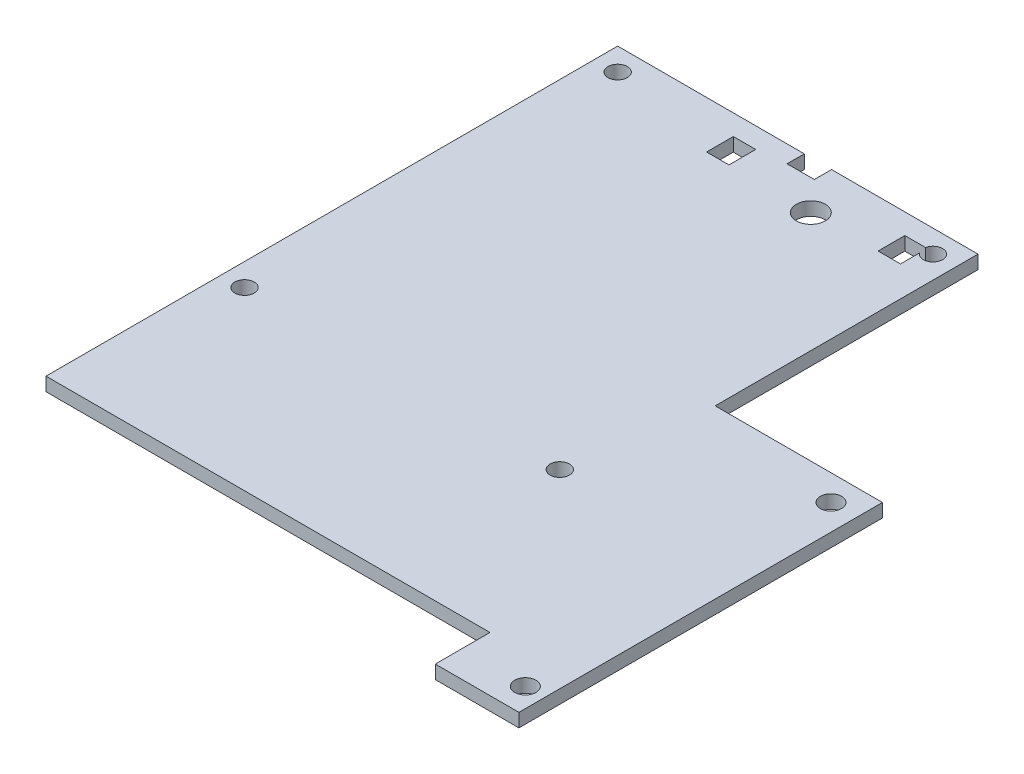
ISO-10303-21;
HEADER;
FILE_DESCRIPTION(('STEP AP214'),'2;1');
FILE_NAME('part.step','',(''),(''),'','','');
FILE_SCHEMA(('AUTOMOTIVE_DESIGN { 1 0 10303 214 1 1 1 1 }'));
ENDSEC;
DATA;
#1=APPLICATION_CONTEXT('core data for automotive mechanical design processes');
#2=APPLICATION_PROTOCOL_DEFINITION('international standard','automotive_design',2000,#1);
#3=PRODUCT_CONTEXT('',#1,'mechanical');
#4=PRODUCT('Part','Part','',(#3));
#5=PRODUCT_RELATED_PRODUCT_CATEGORY('part','',(#4));
#6=PRODUCT_DEFINITION_FORMATION('','',#4);
#7=PRODUCT_DEFINITION_CONTEXT('part definition',#1,'design');
#8=PRODUCT_DEFINITION('design','',#6,#7);
#9=PRODUCT_DEFINITION_SHAPE('','',#8);
#10=(LENGTH_UNIT() NAMED_UNIT(*) SI_UNIT(.MILLI.,.METRE.));
#11=(NAMED_UNIT(*) PLANE_ANGLE_UNIT() SI_UNIT($,.RADIAN.));
#12=(NAMED_UNIT(*) SI_UNIT($,.STERADIAN.) SOLID_ANGLE_UNIT());
#13=UNCERTAINTY_MEASURE_WITH_UNIT(LENGTH_MEASURE(1.E-05),#10,'distance_accuracy_value','');
#14=(GEOMETRIC_REPRESENTATION_CONTEXT(3) GLOBAL_UNCERTAINTY_ASSIGNED_CONTEXT((#13)) GLOBAL_UNIT_ASSIGNED_CONTEXT((#10,
#11,#12)) REPRESENTATION_CONTEXT('',''));
#15=CARTESIAN_POINT('',(0.,0.,0.));
#16=DIRECTION('',(0.,0.,1.));
#17=DIRECTION('',(1.,0.,0.));
#18=AXIS2_PLACEMENT_3D('',#15,#16,#17);
#19=CARTESIAN_POINT('',(0.,-2.1,-88.85));
#20=DIRECTION('',(0.,0.,1.));
#21=DIRECTION('',(1.,0.,0.));
#22=AXIS2_PLACEMENT_3D('',#19,#20,#21);
#23=PLANE('',#22);
#24=DIRECTION('',(1.,0.,0.));
#25=VECTOR('',#24,1.);
#26=CARTESIAN_POINT('',(0.,0.,-88.85));
#27=LINE('',#26,#25);
#28=CARTESIAN_POINT('',(33.24,0.,-88.85));
#29=VERTEX_POINT('',#28);
#30=CARTESIAN_POINT('',(56.,0.,-88.85));
#31=VERTEX_POINT('',#30);
#32=EDGE_CURVE('E255',#29,#31,#27,.T.);
#33=ORIENTED_EDGE('',*,*,#32,.T.);
#34=DIRECTION('',(0.,1.,0.));
#35=VECTOR('',#34,1.);
#36=CARTESIAN_POINT('',(56.,-2.1,-88.85));
#37=LINE('',#36,#35);
#38=CARTESIAN_POINT('',(56.,-2.1,-88.85));
#39=VERTEX_POINT('',#38);
#40=EDGE_CURVE('E11',#39,#31,#37,.T.);
#41=ORIENTED_EDGE('',*,*,#40,.F.);
#42=DIRECTION('',(1.,0.,0.));
#43=VECTOR('',#42,1.);
#44=CARTESIAN_POINT('',(0.,-2.1,-88.85));
#45=LINE('',#44,#43);
#46=CARTESIAN_POINT('',(33.24,-2.1,-88.85));
#47=VERTEX_POINT('',#46);
#48=EDGE_CURVE('E369',#47,#39,#45,.T.);
#49=ORIENTED_EDGE('',*,*,#48,.F.);
#50=DIRECTION('',(0.,1.,0.));
#51=VECTOR('',#50,1.);
#52=CARTESIAN_POINT('',(33.24,-2.1,-88.85));
#53=LINE('',#52,#51);
#54=EDGE_CURVE('E302',#47,#29,#53,.T.);
#55=ORIENTED_EDGE('',*,*,#54,.T.);
#56=EDGE_LOOP('',(#33,#41,#49,#55));
#57=FACE_BOUND('',#56,.T.);
#58=ADVANCED_FACE('F34',(#57),#23,.F.);
#59=CARTESIAN_POINT('',(56.,-2.1,0.));
#60=DIRECTION('',(-1.,0.,0.));
#61=DIRECTION('',(0.,0.,1.));
#62=AXIS2_PLACEMENT_3D('',#59,#60,#61);
#63=PLANE('',#62);
#64=DIRECTION('',(0.,0.,1.));
#65=VECTOR('',#64,1.);
#66=CARTESIAN_POINT('',(56.,0.,0.));
#67=LINE('',#66,#65);
#68=CARTESIAN_POINT('',(56.,0.,-48.));
#69=VERTEX_POINT('',#68);
#70=EDGE_CURVE('E117',#31,#69,#67,.T.);
#71=ORIENTED_EDGE('',*,*,#70,.T.);
#72=DIRECTION('',(0.,1.,0.));
#73=VECTOR('',#72,1.);
#74=CARTESIAN_POINT('',(56.,-2.1,-48.));
#75=LINE('',#74,#73);
#76=CARTESIAN_POINT('',(56.,-2.1,-48.));
#77=VERTEX_POINT('',#76);
#78=EDGE_CURVE('E44',#77,#69,#75,.T.);
#79=ORIENTED_EDGE('',*,*,#78,.F.);
#80=DIRECTION('',(0.,0.,1.));
#81=VECTOR('',#80,1.);
#82=CARTESIAN_POINT('',(56.,-2.1,0.));
#83=LINE('',#82,#81);
#84=EDGE_CURVE('E52',#39,#77,#83,.T.);
#85=ORIENTED_EDGE('',*,*,#84,.F.);
#86=ORIENTED_EDGE('',*,*,#40,.T.);
#87=EDGE_LOOP('',(#71,#79,#85,#86));
#88=FACE_BOUND('',#87,.T.);
#89=ADVANCED_FACE('F420',(#88),#63,.F.);
#90=CARTESIAN_POINT('',(0.,-2.1,-48.));
#91=DIRECTION('',(0.,0.,1.));
#92=DIRECTION('',(1.,0.,0.));
#93=AXIS2_PLACEMENT_3D('',#90,#91,#92);
#94=PLANE('',#93);
#95=DIRECTION('',(1.,0.,0.));
#96=VECTOR('',#95,1.);
#97=CARTESIAN_POINT('',(0.,0.,-48.));
#98=LINE('',#97,#96);
#99=CARTESIAN_POINT('',(82.,0.,-48.));
#100=VERTEX_POINT('',#99);
#101=EDGE_CURVE('E196',#69,#100,#98,.T.);
#102=ORIENTED_EDGE('',*,*,#101,.T.);
#103=DIRECTION('',(0.,1.,0.));
#104=VECTOR('',#103,1.);
#105=CARTESIAN_POINT('',(82.,-2.1,-48.));
#106=LINE('',#105,#104);
#107=CARTESIAN_POINT('',(82.,-2.1,-48.));
#108=VERTEX_POINT('',#107);
#109=EDGE_CURVE('E194',#108,#100,#106,.T.);
#110=ORIENTED_EDGE('',*,*,#109,.F.);
#111=DIRECTION('',(1.,0.,0.));
#112=VECTOR('',#111,1.);
#113=CARTESIAN_POINT('',(0.,-2.1,-48.));
#114=LINE('',#113,#112);
#115=EDGE_CURVE('E185',#77,#108,#114,.T.);
#116=ORIENTED_EDGE('',*,*,#115,.F.);
#117=ORIENTED_EDGE('',*,*,#78,.T.);
#118=EDGE_LOOP('',(#102,#110,#116,#117));
#119=FACE_BOUND('',#118,.T.);
#120=ADVANCED_FACE('F195',(#119),#94,.F.);
#121=CARTESIAN_POINT('',(82.,-2.1,0.));
#122=DIRECTION('',(-1.,0.,0.));
#123=DIRECTION('',(0.,0.,1.));
#124=AXIS2_PLACEMENT_3D('',#121,#122,#123);
#125=PLANE('',#124);
#126=DIRECTION('',(0.,0.,1.));
#127=VECTOR('',#126,1.);
#128=CARTESIAN_POINT('',(82.,0.,0.));
#129=LINE('',#128,#127);
#130=CARTESIAN_POINT('',(82.,0.,8.5));
#131=VERTEX_POINT('',#130);
#132=EDGE_CURVE('E275',#100,#131,#129,.T.);
#133=ORIENTED_EDGE('',*,*,#132,.T.);
#134=DIRECTION('',(0.,1.,0.));
#135=VECTOR('',#134,1.);
#136=CARTESIAN_POINT('',(82.,-2.1,8.5));
#137=LINE('',#136,#135);
#138=CARTESIAN_POINT('',(82.,-2.1,8.5));
#139=VERTEX_POINT('',#138);
#140=EDGE_CURVE('E199',#139,#131,#137,.T.);
#141=ORIENTED_EDGE('',*,*,#140,.F.);
#142=DIRECTION('',(0.,0.,1.));
#143=VECTOR('',#142,1.);
#144=CARTESIAN_POINT('',(82.,-2.1,0.));
#145=LINE('',#144,#143);
#146=EDGE_CURVE('E189',#108,#139,#145,.T.);
#147=ORIENTED_EDGE('',*,*,#146,.F.);
#148=ORIENTED_EDGE('',*,*,#109,.T.);
#149=EDGE_LOOP('',(#133,#141,#147,#148));
#150=FACE_BOUND('',#149,.T.);
#151=ADVANCED_FACE('F201',(#150),#125,.F.);
#152=CARTESIAN_POINT('',(0.,-2.1,8.49999999999994));
#153=DIRECTION('',(0.,0.,-1.));
#154=DIRECTION('',(-1.,0.,0.));
#155=AXIS2_PLACEMENT_3D('',#152,#153,#154);
#156=PLANE('',#155);
#157=DIRECTION('',(-1.,0.,0.));
#158=VECTOR('',#157,1.);
#159=CARTESIAN_POINT('',(0.,0.,8.49999999999994));
#160=LINE('',#159,#158);
#161=CARTESIAN_POINT('',(69.,0.,8.49999999999999));
#162=VERTEX_POINT('',#161);
#163=EDGE_CURVE('E273',#131,#162,#160,.T.);
#164=ORIENTED_EDGE('',*,*,#163,.T.);
#165=DIRECTION('',(0.,1.,0.));
#166=VECTOR('',#165,1.);
#167=CARTESIAN_POINT('',(69.,-2.1,8.49999999999999));
#168=LINE('',#167,#166);
#169=CARTESIAN_POINT('',(69.,-2.1,8.49999999999999));
#170=VERTEX_POINT('',#169);
#171=EDGE_CURVE('E282',#170,#162,#168,.T.);
#172=ORIENTED_EDGE('',*,*,#171,.F.);
#173=DIRECTION('',(-1.,0.,0.));
#174=VECTOR('',#173,1.);
#175=CARTESIAN_POINT('',(0.,-2.1,8.49999999999994));
#176=LINE('',#175,#174);
#177=EDGE_CURVE('E204',#139,#170,#176,.T.);
#178=ORIENTED_EDGE('',*,*,#177,.F.);
#179=ORIENTED_EDGE('',*,*,#140,.T.);
#180=EDGE_LOOP('',(#164,#172,#178,#179));
#181=FACE_BOUND('',#180,.T.);
#182=ADVANCED_FACE('F434',(#181),#156,.F.);
#183=CARTESIAN_POINT('',(69.,-2.1,0.));
#184=DIRECTION('',(1.,0.,0.));
#185=DIRECTION('',(0.,0.,-1.));
#186=AXIS2_PLACEMENT_3D('',#183,#184,#185);
#187=PLANE('',#186);
#188=DIRECTION('',(0.,0.,-1.));
#189=VECTOR('',#188,1.);
#190=CARTESIAN_POINT('',(69.,0.,0.));
#191=LINE('',#190,#189);
#192=CARTESIAN_POINT('',(69.,0.,0.));
#193=VERTEX_POINT('',#192);
#194=EDGE_CURVE('E271',#162,#193,#191,.T.);
#195=ORIENTED_EDGE('',*,*,#194,.T.);
#196=DIRECTION('',(0.,1.,0.));
#197=VECTOR('',#196,1.);
#198=CARTESIAN_POINT('',(69.,-2.1,0.));
#199=LINE('',#198,#197);
#200=CARTESIAN_POINT('',(69.,-2.1,0.));
#201=VERTEX_POINT('',#200);
#202=EDGE_CURVE('E285',#201,#193,#199,.T.);
#203=ORIENTED_EDGE('',*,*,#202,.F.);
#204=DIRECTION('',(0.,0.,-1.));
#205=VECTOR('',#204,1.);
#206=CARTESIAN_POINT('',(69.,-2.1,0.));
#207=LINE('',#206,#205);
#208=EDGE_CURVE('E206',#170,#201,#207,.T.);
#209=ORIENTED_EDGE('',*,*,#208,.F.);
#210=ORIENTED_EDGE('',*,*,#171,.T.);
#211=EDGE_LOOP('',(#195,#203,#209,#210));
#212=FACE_BOUND('',#211,.T.);
#213=ADVANCED_FACE('F388',(#212),#187,.F.);
#214=CARTESIAN_POINT('',(0.,-2.1,0.));
#215=DIRECTION('',(0.,0.,-1.));
#216=DIRECTION('',(-1.,0.,0.));
#217=AXIS2_PLACEMENT_3D('',#214,#215,#216);
#218=PLANE('',#217);
#219=DIRECTION('',(-1.,0.,0.));
#220=VECTOR('',#219,1.);
#221=CARTESIAN_POINT('',(0.,0.,0.));
#222=LINE('',#221,#220);
#223=CARTESIAN_POINT('',(0.,0.,0.));
#224=VERTEX_POINT('',#223);
#225=EDGE_CURVE('E269',#193,#224,#222,.T.);
#226=ORIENTED_EDGE('',*,*,#225,.T.);
#227=DIRECTION('',(0.,1.,0.));
#228=VECTOR('',#227,1.);
#229=CARTESIAN_POINT('',(0.,-2.1,0.));
#230=LINE('',#229,#228);
#231=CARTESIAN_POINT('',(0.,-2.1,0.));
#232=VERTEX_POINT('',#231);
#233=EDGE_CURVE('E288',#232,#224,#230,.T.);
#234=ORIENTED_EDGE('',*,*,#233,.F.);
#235=DIRECTION('',(-1.,0.,0.));
#236=VECTOR('',#235,1.);
#237=CARTESIAN_POINT('',(0.,-2.1,0.));
#238=LINE('',#237,#236);
#239=EDGE_CURVE('E381',#201,#232,#238,.T.);
#240=ORIENTED_EDGE('',*,*,#239,.F.);
#241=ORIENTED_EDGE('',*,*,#202,.T.);
#242=EDGE_LOOP('',(#226,#234,#240,#241));
#243=FACE_BOUND('',#242,.T.);
#244=ADVANCED_FACE('F392',(#243),#218,.F.);
#245=CARTESIAN_POINT('',(0.,-2.1,0.));
#246=DIRECTION('',(1.,0.,0.));
#247=DIRECTION('',(0.,0.,-1.));
#248=AXIS2_PLACEMENT_3D('',#245,#246,#247);
#249=PLANE('',#248);
#250=DIRECTION('',(0.,0.,-1.));
#251=VECTOR('',#250,1.);
#252=CARTESIAN_POINT('',(0.,0.,0.));
#253=LINE('',#252,#251);
#254=CARTESIAN_POINT('',(0.,0.,-88.85));
#255=VERTEX_POINT('',#254);
#256=EDGE_CURVE('E267',#224,#255,#253,.T.);
#257=ORIENTED_EDGE('',*,*,#256,.T.);
#258=DIRECTION('',(0.,1.,0.));
#259=VECTOR('',#258,1.);
#260=CARTESIAN_POINT('',(0.,-2.1,-88.85));
#261=LINE('',#260,#259);
#262=CARTESIAN_POINT('',(0.,-2.1,-88.85));
#263=VERTEX_POINT('',#262);
#264=EDGE_CURVE('E291',#263,#255,#261,.T.);
#265=ORIENTED_EDGE('',*,*,#264,.F.);
#266=DIRECTION('',(0.,0.,-1.));
#267=VECTOR('',#266,1.);
#268=CARTESIAN_POINT('',(0.,-2.1,0.));
#269=LINE('',#268,#267);
#270=EDGE_CURVE('E379',#232,#263,#269,.T.);
#271=ORIENTED_EDGE('',*,*,#270,.F.);
#272=ORIENTED_EDGE('',*,*,#233,.T.);
#273=EDGE_LOOP('',(#257,#265,#271,#272));
#274=FACE_BOUND('',#273,.T.);
#275=ADVANCED_FACE('F397',(#274),#249,.F.);
#276=CARTESIAN_POINT('',(29.01,0.,-88.85));
#277=VERTEX_POINT('',#276);
#278=EDGE_CURVE('E259',#255,#277,#27,.T.);
#279=ORIENTED_EDGE('',*,*,#278,.T.);
#280=DIRECTION('',(0.,1.,0.));
#281=VECTOR('',#280,1.);
#282=CARTESIAN_POINT('',(29.01,-2.1,-88.85));
#283=LINE('',#282,#281);
#284=CARTESIAN_POINT('',(29.01,-2.1,-88.85));
#285=VERTEX_POINT('',#284);
#286=EDGE_CURVE('E294',#285,#277,#283,.T.);
#287=ORIENTED_EDGE('',*,*,#286,.F.);
#288=EDGE_CURVE('E372',#263,#285,#45,.T.);
#289=ORIENTED_EDGE('',*,*,#288,.F.);
#290=ORIENTED_EDGE('',*,*,#264,.T.);
#291=EDGE_LOOP('',(#279,#287,#289,#290));
#292=FACE_BOUND('',#291,.T.);
#293=ADVANCED_FACE('F403',(#292),#23,.F.);
#294=CARTESIAN_POINT('',(29.01,-2.1,0.));
#295=DIRECTION('',(-1.,0.,0.));
#296=DIRECTION('',(0.,0.,1.));
#297=AXIS2_PLACEMENT_3D('',#294,#295,#296);
#298=PLANE('',#297);
#299=DIRECTION('',(0.,0.,1.));
#300=VECTOR('',#299,1.);
#301=CARTESIAN_POINT('',(29.01,0.,0.));
#302=LINE('',#301,#300);
#303=CARTESIAN_POINT('',(29.01,0.,-86.17));
#304=VERTEX_POINT('',#303);
#305=EDGE_CURVE('E265',#277,#304,#302,.T.);
#306=ORIENTED_EDGE('',*,*,#305,.T.);
#307=DIRECTION('',(0.,1.,0.));
#308=VECTOR('',#307,1.);
#309=CARTESIAN_POINT('',(29.01,-2.1,-86.17));
#310=LINE('',#309,#308);
#311=CARTESIAN_POINT('',(29.01,-2.1,-86.17));
#312=VERTEX_POINT('',#311);
#313=EDGE_CURVE('E297',#312,#304,#310,.T.);
#314=ORIENTED_EDGE('',*,*,#313,.F.);
#315=DIRECTION('',(0.,0.,1.));
#316=VECTOR('',#315,1.);
#317=CARTESIAN_POINT('',(29.01,-2.1,0.));
#318=LINE('',#317,#316);
#319=EDGE_CURVE('E377',#285,#312,#318,.T.);
#320=ORIENTED_EDGE('',*,*,#319,.F.);
#321=ORIENTED_EDGE('',*,*,#286,.T.);
#322=EDGE_LOOP('',(#306,#314,#320,#321));
#323=FACE_BOUND('',#322,.T.);
#324=ADVANCED_FACE('F407',(#323),#298,.F.);
#325=CARTESIAN_POINT('',(0.,-2.1,-86.17));
#326=DIRECTION('',(0.,0.,1.));
#327=DIRECTION('',(1.,0.,0.));
#328=AXIS2_PLACEMENT_3D('',#325,#326,#327);
#329=PLANE('',#328);
#330=DIRECTION('',(1.,0.,0.));
#331=VECTOR('',#330,1.);
#332=CARTESIAN_POINT('',(0.,0.,-86.17));
#333=LINE('',#332,#331);
#334=CARTESIAN_POINT('',(33.24,0.,-86.17));
#335=VERTEX_POINT('',#334);
#336=EDGE_CURVE('E262',#304,#335,#333,.T.);
#337=ORIENTED_EDGE('',*,*,#336,.T.);
#338=DIRECTION('',(0.,1.,0.));
#339=VECTOR('',#338,1.);
#340=CARTESIAN_POINT('',(33.24,-2.1,-86.17));
#341=LINE('',#340,#339);
#342=CARTESIAN_POINT('',(33.24,-2.1,-86.17));
#343=VERTEX_POINT('',#342);
#344=EDGE_CURVE('E300',#343,#335,#341,.T.);
#345=ORIENTED_EDGE('',*,*,#344,.F.);
#346=DIRECTION('',(1.,0.,0.));
#347=VECTOR('',#346,1.);
#348=CARTESIAN_POINT('',(0.,-2.1,-86.17));
#349=LINE('',#348,#347);
#350=EDGE_CURVE('E375',#312,#343,#349,.T.);
#351=ORIENTED_EDGE('',*,*,#350,.F.);
#352=ORIENTED_EDGE('',*,*,#313,.T.);
#353=EDGE_LOOP('',(#337,#345,#351,#352));
#354=FACE_BOUND('',#353,.T.);
#355=ADVANCED_FACE('F412',(#354),#329,.F.);
#356=CARTESIAN_POINT('',(0.,-2.1,-85.66));
#357=DIRECTION('',(0.,0.,1.));
#358=DIRECTION('',(1.,0.,0.));
#359=AXIS2_PLACEMENT_3D('',#356,#357,#358);
#360=PLANE('',#359);
#361=DIRECTION('',(1.,0.,0.));
#362=VECTOR('',#361,1.);
#363=CARTESIAN_POINT('',(0.,0.,-85.66));
#364=LINE('',#363,#362);
#365=CARTESIAN_POINT('',(21.16,0.,-85.66));
#366=VERTEX_POINT('',#365);
#367=CARTESIAN_POINT('',(24.64,0.,-85.66));
#368=VERTEX_POINT('',#367);
#369=EDGE_CURVE('E243',#366,#368,#364,.T.);
#370=ORIENTED_EDGE('',*,*,#369,.F.);
#371=DIRECTION('',(0.,1.,0.));
#372=VECTOR('',#371,1.);
#373=CARTESIAN_POINT('',(21.16,-2.1,-85.66));
#374=LINE('',#373,#372);
#375=CARTESIAN_POINT('',(21.16,-2.1,-85.66));
#376=VERTEX_POINT('',#375);
#377=EDGE_CURVE('E304',#376,#366,#374,.T.);
#378=ORIENTED_EDGE('',*,*,#377,.F.);
#379=DIRECTION('',(1.,0.,0.));
#380=VECTOR('',#379,1.);
#381=CARTESIAN_POINT('',(0.,-2.1,-85.66));
#382=LINE('',#381,#380);
#383=CARTESIAN_POINT('',(24.64,-2.1,-85.66));
#384=VERTEX_POINT('',#383);
#385=EDGE_CURVE('E358',#376,#384,#382,.T.);
#386=ORIENTED_EDGE('',*,*,#385,.T.);
#387=DIRECTION('',(0.,1.,0.));
#388=VECTOR('',#387,1.);
#389=CARTESIAN_POINT('',(24.64,-2.1,-85.66));
#390=LINE('',#389,#388);
#391=EDGE_CURVE('E311',#384,#368,#390,.T.);
#392=ORIENTED_EDGE('',*,*,#391,.T.);
#393=EDGE_LOOP('',(#370,#378,#386,#392));
#394=FACE_BOUND('',#393,.T.);
#395=ADVANCED_FACE('F449',(#394),#360,.T.);
#396=CARTESIAN_POINT('',(21.16,-2.1,0.));
#397=DIRECTION('',(-1.,0.,0.));
#398=DIRECTION('',(0.,0.,1.));
#399=AXIS2_PLACEMENT_3D('',#396,#397,#398);
#400=PLANE('',#399);
#401=DIRECTION('',(0.,0.,1.));
#402=VECTOR('',#401,1.);
#403=CARTESIAN_POINT('',(21.16,0.,0.));
#404=LINE('',#403,#402);
#405=CARTESIAN_POINT('',(21.16,0.,-81.5));
#406=VERTEX_POINT('',#405);
#407=EDGE_CURVE('E252',#366,#406,#404,.T.);
#408=ORIENTED_EDGE('',*,*,#407,.T.);
#409=DIRECTION('',(0.,1.,0.));
#410=VECTOR('',#409,1.);
#411=CARTESIAN_POINT('',(21.16,-2.1,-81.5));
#412=LINE('',#411,#410);
#413=CARTESIAN_POINT('',(21.16,-2.1,-81.5));
#414=VERTEX_POINT('',#413);
#415=EDGE_CURVE('E306',#414,#406,#412,.T.);
#416=ORIENTED_EDGE('',*,*,#415,.F.);
#417=DIRECTION('',(0.,0.,1.));
#418=VECTOR('',#417,1.);
#419=CARTESIAN_POINT('',(21.16,-2.1,0.));
#420=LINE('',#419,#418);
#421=EDGE_CURVE('E366',#376,#414,#420,.T.);
#422=ORIENTED_EDGE('',*,*,#421,.F.);
#423=ORIENTED_EDGE('',*,*,#377,.T.);
#424=EDGE_LOOP('',(#408,#416,#422,#423));
#425=FACE_BOUND('',#424,.T.);
#426=ADVANCED_FACE('F452',(#425),#400,.F.);
#427=CARTESIAN_POINT('',(-3.25011409866919E-13,-2.1,-81.4999999999999));
#428=DIRECTION('',(0.,0.,1.));
#429=DIRECTION('',(1.,0.,0.));
#430=AXIS2_PLACEMENT_3D('',#427,#428,#429);
#431=PLANE('',#430);
#432=DIRECTION('',(1.,0.,0.));
#433=VECTOR('',#432,1.);
#434=CARTESIAN_POINT('',(-3.25011409866919E-13,0.,-81.4999999999999));
#435=LINE('',#434,#433);
#436=CARTESIAN_POINT('',(24.64,0.,-81.5));
#437=VERTEX_POINT('',#436);
#438=EDGE_CURVE('E249',#406,#437,#435,.T.);
#439=ORIENTED_EDGE('',*,*,#438,.T.);
#440=DIRECTION('',(0.,1.,0.));
#441=VECTOR('',#440,1.);
#442=CARTESIAN_POINT('',(24.64,-2.1,-81.5));
#443=LINE('',#442,#441);
#444=CARTESIAN_POINT('',(24.64,-2.1,-81.5));
#445=VERTEX_POINT('',#444);
#446=EDGE_CURVE('E309',#445,#437,#443,.T.);
#447=ORIENTED_EDGE('',*,*,#446,.F.);
#448=DIRECTION('',(1.,0.,0.));
#449=VECTOR('',#448,1.);
#450=CARTESIAN_POINT('',(-3.25011409866919E-13,-2.1,-81.4999999999999));
#451=LINE('',#450,#449);
#452=EDGE_CURVE('E364',#414,#445,#451,.T.);
#453=ORIENTED_EDGE('',*,*,#452,.F.);
#454=ORIENTED_EDGE('',*,*,#415,.T.);
#455=EDGE_LOOP('',(#439,#447,#453,#454));
#456=FACE_BOUND('',#455,.T.);
#457=ADVANCED_FACE('F455',(#456),#431,.F.);
#458=CARTESIAN_POINT('',(52.5,-2.1,-85.35));
#459=DIRECTION('',(0.,1.,0.));
#460=DIRECTION('',(0.,0.,1.));
#461=AXIS2_PLACEMENT_3D('',#458,#459,#460);
#462=CYLINDRICAL_SURFACE('',#461,1.50000000000002);
#463=CARTESIAN_POINT('',(52.5,0.,-85.35));
#464=DIRECTION('',(0.,1.,0.));
#465=DIRECTION('',(0.,0.,1.));
#466=AXIS2_PLACEMENT_3D('',#463,#464,#465);
#467=CIRCLE('',#466,1.50000000000002);
#468=CARTESIAN_POINT('',(51.3,0.,-84.45));
#469=VERTEX_POINT('',#468);
#470=CARTESIAN_POINT('',(51.0323828837193,0.,-85.66));
#471=VERTEX_POINT('',#470);
#472=EDGE_CURVE('E226',#469,#471,#467,.T.);
#473=ORIENTED_EDGE('',*,*,#472,.T.);
#474=DIRECTION('',(0.,1.,0.));
#475=VECTOR('',#474,1.);
#476=CARTESIAN_POINT('',(51.0323828837193,-2.1,-85.66));
#477=LINE('',#476,#475);
#478=CARTESIAN_POINT('',(51.0323828837193,-2.1,-85.66));
#479=VERTEX_POINT('',#478);
#480=EDGE_CURVE('E313',#479,#471,#477,.T.);
#481=ORIENTED_EDGE('',*,*,#480,.F.);
#482=CARTESIAN_POINT('',(52.5,-2.1,-85.35));
#483=DIRECTION('',(0.,1.,0.));
#484=DIRECTION('',(0.,0.,1.));
#485=AXIS2_PLACEMENT_3D('',#482,#483,#484);
#486=CIRCLE('',#485,1.50000000000002);
#487=CARTESIAN_POINT('',(51.3,-2.1,-84.45));
#488=VERTEX_POINT('',#487);
#489=EDGE_CURVE('E328',#488,#479,#486,.T.);
#490=ORIENTED_EDGE('',*,*,#489,.F.);
#491=DIRECTION('',(0.,1.,0.));
#492=VECTOR('',#491,1.);
#493=CARTESIAN_POINT('',(51.3,-2.1,-84.45));
#494=LINE('',#493,#492);
#495=EDGE_CURVE('E38',#488,#469,#494,.T.);
#496=ORIENTED_EDGE('',*,*,#495,.T.);
#497=EDGE_LOOP('',(#473,#481,#490,#496));
#498=FACE_BOUND('',#497,.T.);
#499=ADVANCED_FACE('F326',(#498),#462,.F.);
#500=CARTESIAN_POINT('',(0.,-2.1,-85.66));
#501=DIRECTION('',(0.,0.,-1.));
#502=DIRECTION('',(-1.,0.,0.));
#503=AXIS2_PLACEMENT_3D('',#500,#501,#502);
#504=PLANE('',#503);
#505=DIRECTION('',(-1.,0.,0.));
#506=VECTOR('',#505,1.);
#507=CARTESIAN_POINT('',(0.,0.,-85.66));
#508=LINE('',#507,#506);
#509=CARTESIAN_POINT('',(47.82,0.,-85.66));
#510=VERTEX_POINT('',#509);
#511=EDGE_CURVE('E237',#471,#510,#508,.T.);
#512=ORIENTED_EDGE('',*,*,#511,.T.);
#513=DIRECTION('',(0.,1.,0.));
#514=VECTOR('',#513,1.);
#515=CARTESIAN_POINT('',(47.82,-2.1,-85.66));
#516=LINE('',#515,#514);
#517=CARTESIAN_POINT('',(47.82,-2.1,-85.66));
#518=VERTEX_POINT('',#517);
#519=EDGE_CURVE('E316',#518,#510,#516,.T.);
#520=ORIENTED_EDGE('',*,*,#519,.F.);
#521=DIRECTION('',(-1.,0.,0.));
#522=VECTOR('',#521,1.);
#523=CARTESIAN_POINT('',(0.,-2.1,-85.66));
#524=LINE('',#523,#522);
#525=EDGE_CURVE('E337',#479,#518,#524,.T.);
#526=ORIENTED_EDGE('',*,*,#525,.F.);
#527=ORIENTED_EDGE('',*,*,#480,.T.);
#528=EDGE_LOOP('',(#512,#520,#526,#527));
#529=FACE_BOUND('',#528,.T.);
#530=ADVANCED_FACE('F336',(#529),#504,.F.);
#531=CARTESIAN_POINT('',(47.82,-2.1,0.));
#532=DIRECTION('',(1.,0.,0.));
#533=DIRECTION('',(0.,0.,-1.));
#534=AXIS2_PLACEMENT_3D('',#531,#532,#533);
#535=PLANE('',#534);
#536=DIRECTION('',(0.,0.,-1.));
#537=VECTOR('',#536,1.);
#538=CARTESIAN_POINT('',(47.82,0.,0.));
#539=LINE('',#538,#537);
#540=CARTESIAN_POINT('',(47.82,0.,-81.5));
#541=VERTEX_POINT('',#540);
#542=EDGE_CURVE('E234',#541,#510,#539,.T.);
#543=ORIENTED_EDGE('',*,*,#542,.F.);
#544=DIRECTION('',(0.,1.,0.));
#545=VECTOR('',#544,1.);
#546=CARTESIAN_POINT('',(47.82,-2.1,-81.5));
#547=LINE('',#546,#545);
#548=CARTESIAN_POINT('',(47.82,-2.1,-81.5));
#549=VERTEX_POINT('',#548);
#550=EDGE_CURVE('E318',#549,#541,#547,.T.);
#551=ORIENTED_EDGE('',*,*,#550,.F.);
#552=DIRECTION('',(0.,0.,-1.));
#553=VECTOR('',#552,1.);
#554=CARTESIAN_POINT('',(47.82,-2.1,0.));
#555=LINE('',#554,#553);
#556=EDGE_CURVE('E341',#549,#518,#555,.T.);
#557=ORIENTED_EDGE('',*,*,#556,.T.);
#558=ORIENTED_EDGE('',*,*,#519,.T.);
#559=EDGE_LOOP('',(#543,#551,#557,#558));
#560=FACE_BOUND('',#559,.T.);
#561=ADVANCED_FACE('F475',(#560),#535,.T.);
#562=CARTESIAN_POINT('',(0.,-2.1,-81.5));
#563=DIRECTION('',(0.,0.,-1.));
#564=DIRECTION('',(-1.,0.,0.));
#565=AXIS2_PLACEMENT_3D('',#562,#563,#564);
#566=PLANE('',#565);
#567=DIRECTION('',(-1.,0.,0.));
#568=VECTOR('',#567,1.);
#569=CARTESIAN_POINT('',(0.,0.,-81.5));
#570=LINE('',#569,#568);
#571=CARTESIAN_POINT('',(51.3,0.,-81.5));
#572=VERTEX_POINT('',#571);
#573=EDGE_CURVE('E231',#572,#541,#570,.T.);
#574=ORIENTED_EDGE('',*,*,#573,.F.);
#575=DIRECTION('',(0.,1.,0.));
#576=VECTOR('',#575,1.);
#577=CARTESIAN_POINT('',(51.3,-2.1,-81.5));
#578=LINE('',#577,#576);
#579=CARTESIAN_POINT('',(51.3,-2.1,-81.5));
#580=VERTEX_POINT('',#579);
#581=EDGE_CURVE('E319',#580,#572,#578,.T.);
#582=ORIENTED_EDGE('',*,*,#581,.F.);
#583=DIRECTION('',(-1.,0.,0.));
#584=VECTOR('',#583,1.);
#585=CARTESIAN_POINT('',(0.,-2.1,-81.5));
#586=LINE('',#585,#584);
#587=EDGE_CURVE('E346',#580,#549,#586,.T.);
#588=ORIENTED_EDGE('',*,*,#587,.T.);
#589=ORIENTED_EDGE('',*,*,#550,.T.);
#590=EDGE_LOOP('',(#574,#582,#588,#589));
#591=FACE_BOUND('',#590,.T.);
#592=ADVANCED_FACE('F464',(#591),#566,.T.);
#593=CARTESIAN_POINT('',(24.64,-2.1,0.));
#594=DIRECTION('',(-1.,0.,0.));
#595=DIRECTION('',(0.,0.,1.));
#596=AXIS2_PLACEMENT_3D('',#593,#594,#595);
#597=PLANE('',#596);
#598=DIRECTION('',(0.,0.,1.));
#599=VECTOR('',#598,1.);
#600=CARTESIAN_POINT('',(24.64,0.,0.));
#601=LINE('',#600,#599);
#602=EDGE_CURVE('E246',#368,#437,#601,.T.);
#603=ORIENTED_EDGE('',*,*,#602,.F.);
#604=ORIENTED_EDGE('',*,*,#391,.F.);
#605=DIRECTION('',(0.,0.,1.));
#606=VECTOR('',#605,1.);
#607=CARTESIAN_POINT('',(24.64,-2.1,0.));
#608=LINE('',#607,#606);
#609=EDGE_CURVE('E361',#384,#445,#608,.T.);
#610=ORIENTED_EDGE('',*,*,#609,.T.);
#611=ORIENTED_EDGE('',*,*,#446,.T.);
#612=EDGE_LOOP('',(#603,#604,#610,#611));
#613=FACE_BOUND('',#612,.T.);
#614=ADVANCED_FACE('F460',(#613),#597,.T.);
#615=CARTESIAN_POINT('',(3.5,-2.1,-85.35));
#616=DIRECTION('',(0.,1.,0.));
#617=DIRECTION('',(0.,0.,1.));
#618=AXIS2_PLACEMENT_3D('',#615,#616,#617);
#619=CYLINDRICAL_SURFACE('',#618,1.5);
#620=CARTESIAN_POINT('',(3.5,-2.1,-85.35));
#621=DIRECTION('',(0.,1.,0.));
#622=DIRECTION('',(0.,0.,1.));
#623=AXIS2_PLACEMENT_3D('',#620,#621,#622);
#624=CIRCLE('',#623,1.5);
#625=CARTESIAN_POINT('',(3.5,-2.1,-83.85));
#626=VERTEX_POINT('',#625);
#627=EDGE_CURVE('E340',#626,#626,#624,.T.);
#628=ORIENTED_EDGE('',*,*,#627,.F.);
#629=EDGE_LOOP('',(#628));
#630=FACE_BOUND('',#629,.T.);
#631=CARTESIAN_POINT('',(3.5,0.,-85.35));
#632=DIRECTION('',(0.,1.,0.));
#633=DIRECTION('',(0.,0.,1.));
#634=AXIS2_PLACEMENT_3D('',#631,#632,#633);
#635=CIRCLE('',#634,1.5);
#636=CARTESIAN_POINT('',(3.5,0.,-83.85));
#637=VERTEX_POINT('',#636);
#638=EDGE_CURVE('E240',#637,#637,#635,.T.);
#639=ORIENTED_EDGE('',*,*,#638,.T.);
#640=EDGE_LOOP('',(#639));
#641=FACE_BOUND('',#640,.T.);
#642=ADVANCED_FACE('F463',(#630,#641),#619,.F.);
#643=CARTESIAN_POINT('',(51.3,-2.1,0.));
#644=DIRECTION('',(1.,0.,0.));
#645=DIRECTION('',(0.,0.,-1.));
#646=AXIS2_PLACEMENT_3D('',#643,#644,#645);
#647=PLANE('',#646);
#648=DIRECTION('',(0.,0.,-1.));
#649=VECTOR('',#648,1.);
#650=CARTESIAN_POINT('',(51.3,0.,0.));
#651=LINE('',#650,#649);
#652=EDGE_CURVE('E229',#572,#469,#651,.T.);
#653=ORIENTED_EDGE('',*,*,#652,.T.);
#654=ORIENTED_EDGE('',*,*,#495,.F.);
#655=DIRECTION('',(0.,0.,-1.));
#656=VECTOR('',#655,1.);
#657=CARTESIAN_POINT('',(51.3,-2.1,0.));
#658=LINE('',#657,#656);
#659=EDGE_CURVE('E130',#580,#488,#658,.T.);
#660=ORIENTED_EDGE('',*,*,#659,.F.);
#661=ORIENTED_EDGE('',*,*,#581,.T.);
#662=EDGE_LOOP('',(#653,#654,#660,#661));
#663=FACE_BOUND('',#662,.T.);
#664=ADVANCED_FACE('F471',(#663),#647,.F.);
#665=CARTESIAN_POINT('',(37.42,-2.1,-81.45));
#666=DIRECTION('',(0.,1.,0.));
#667=DIRECTION('',(0.,0.,1.));
#668=AXIS2_PLACEMENT_3D('',#665,#666,#667);
#669=CYLINDRICAL_SURFACE('',#668,2.25);
#670=CARTESIAN_POINT('',(37.42,-2.1,-81.45));
#671=DIRECTION('',(0.,1.,0.));
#672=DIRECTION('',(0.,0.,1.));
#673=AXIS2_PLACEMENT_3D('',#670,#671,#672);
#674=CIRCLE('',#673,2.25);
#675=CARTESIAN_POINT('',(37.42,-2.1,-79.2));
#676=VERTEX_POINT('',#675);
#677=EDGE_CURVE('E344',#676,#676,#674,.T.);
#678=ORIENTED_EDGE('',*,*,#677,.F.);
#679=EDGE_LOOP('',(#678));
#680=FACE_BOUND('',#679,.T.);
#681=CARTESIAN_POINT('',(37.42,0.,-81.45));
#682=DIRECTION('',(0.,1.,0.));
#683=DIRECTION('',(0.,0.,1.));
#684=AXIS2_PLACEMENT_3D('',#681,#682,#683);
#685=CIRCLE('',#684,2.25);
#686=CARTESIAN_POINT('',(37.42,0.,-79.2));
#687=VERTEX_POINT('',#686);
#688=EDGE_CURVE('E223',#687,#687,#685,.T.);
#689=ORIENTED_EDGE('',*,*,#688,.T.);
#690=EDGE_LOOP('',(#689));
#691=FACE_BOUND('',#690,.T.);
#692=ADVANCED_FACE('F484',(#680,#691),#669,.F.);
#693=CARTESIAN_POINT('',(3.5,-2.1,-27.35));
#694=DIRECTION('',(0.,1.,0.));
#695=DIRECTION('',(0.,0.,1.));
#696=AXIS2_PLACEMENT_3D('',#693,#694,#695);
#697=CYLINDRICAL_SURFACE('',#696,1.5);
#698=CARTESIAN_POINT('',(3.5,-2.1,-27.35));
#699=DIRECTION('',(0.,1.,0.));
#700=DIRECTION('',(0.,0.,1.));
#701=AXIS2_PLACEMENT_3D('',#698,#699,#700);
#702=CIRCLE('',#701,1.5);
#703=CARTESIAN_POINT('',(3.5,-2.1,-25.85));
#704=VERTEX_POINT('',#703);
#705=EDGE_CURVE('E349',#704,#704,#702,.T.);
#706=ORIENTED_EDGE('',*,*,#705,.F.);
#707=EDGE_LOOP('',(#706));
#708=FACE_BOUND('',#707,.T.);
#709=CARTESIAN_POINT('',(3.5,0.,-27.35));
#710=DIRECTION('',(0.,1.,0.));
#711=DIRECTION('',(0.,0.,1.));
#712=AXIS2_PLACEMENT_3D('',#709,#710,#711);
#713=CIRCLE('',#712,1.5);
#714=CARTESIAN_POINT('',(3.5,0.,-25.85));
#715=VERTEX_POINT('',#714);
#716=EDGE_CURVE('E220',#715,#715,#713,.T.);
#717=ORIENTED_EDGE('',*,*,#716,.T.);
#718=EDGE_LOOP('',(#717));
#719=FACE_BOUND('',#718,.T.);
#720=ADVANCED_FACE('F489',(#708,#719),#697,.F.);
#721=CARTESIAN_POINT('',(52.5,-2.1,-27.35));
#722=DIRECTION('',(0.,1.,0.));
#723=DIRECTION('',(0.,0.,1.));
#724=AXIS2_PLACEMENT_3D('',#721,#722,#723);
#725=CYLINDRICAL_SURFACE('',#724,1.5);
#726=CARTESIAN_POINT('',(52.5,-2.1,-27.35));
#727=DIRECTION('',(0.,1.,0.));
#728=DIRECTION('',(0.,0.,1.));
#729=AXIS2_PLACEMENT_3D('',#726,#727,#728);
#730=CIRCLE('',#729,1.5);
#731=CARTESIAN_POINT('',(52.5,-2.1,-25.85));
#732=VERTEX_POINT('',#731);
#733=EDGE_CURVE('E536',#732,#732,#730,.T.);
#734=ORIENTED_EDGE('',*,*,#733,.F.);
#735=EDGE_LOOP('',(#734));
#736=FACE_BOUND('',#735,.T.);
#737=CARTESIAN_POINT('',(52.5,0.,-27.35));
#738=DIRECTION('',(0.,1.,0.));
#739=DIRECTION('',(0.,0.,1.));
#740=AXIS2_PLACEMENT_3D('',#737,#738,#739);
#741=CIRCLE('',#740,1.5);
#742=CARTESIAN_POINT('',(52.5,0.,-25.85));
#743=VERTEX_POINT('',#742);
#744=EDGE_CURVE('E217',#743,#743,#741,.T.);
#745=ORIENTED_EDGE('',*,*,#744,.T.);
#746=EDGE_LOOP('',(#745));
#747=FACE_BOUND('',#746,.T.);
#748=ADVANCED_FACE('F493',(#736,#747),#725,.F.);
#749=CARTESIAN_POINT('',(78.,-2.1,-44.));
#750=DIRECTION('',(0.,1.,0.));
#751=DIRECTION('',(0.,0.,1.));
#752=AXIS2_PLACEMENT_3D('',#749,#750,#751);
#753=CYLINDRICAL_SURFACE('',#752,1.65);
#754=CARTESIAN_POINT('',(78.,-2.1,-44.));
#755=DIRECTION('',(0.,1.,0.));
#756=DIRECTION('',(0.,0.,1.));
#757=AXIS2_PLACEMENT_3D('',#754,#755,#756);
#758=CIRCLE('',#757,1.65);
#759=CARTESIAN_POINT('',(78.,-2.1,-42.35));
#760=VERTEX_POINT('',#759);
#761=EDGE_CURVE('E507',#760,#760,#758,.T.);
#762=ORIENTED_EDGE('',*,*,#761,.F.);
#763=EDGE_LOOP('',(#762));
#764=FACE_BOUND('',#763,.T.);
#765=CARTESIAN_POINT('',(78.,0.,-44.));
#766=DIRECTION('',(0.,1.,0.));
#767=DIRECTION('',(0.,0.,1.));
#768=AXIS2_PLACEMENT_3D('',#765,#766,#767);
#769=CIRCLE('',#768,1.65);
#770=CARTESIAN_POINT('',(78.,0.,-42.35));
#771=VERTEX_POINT('',#770);
#772=EDGE_CURVE('E214',#771,#771,#769,.T.);
#773=ORIENTED_EDGE('',*,*,#772,.T.);
#774=EDGE_LOOP('',(#773));
#775=FACE_BOUND('',#774,.T.);
#776=ADVANCED_FACE('F496',(#764,#775),#753,.F.);
#777=CARTESIAN_POINT('',(79.,-2.1,4.5));
#778=DIRECTION('',(0.,1.,0.));
#779=DIRECTION('',(0.,0.,1.));
#780=AXIS2_PLACEMENT_3D('',#777,#778,#779);
#781=CYLINDRICAL_SURFACE('',#780,1.65);
#782=CARTESIAN_POINT('',(79.,-2.1,4.5));
#783=DIRECTION('',(0.,1.,0.));
#784=DIRECTION('',(0.,0.,1.));
#785=AXIS2_PLACEMENT_3D('',#782,#783,#784);
#786=CIRCLE('',#785,1.65);
#787=CARTESIAN_POINT('',(79.,-2.1,6.15000000000001));
#788=VERTEX_POINT('',#787);
#789=EDGE_CURVE('E278',#788,#788,#786,.T.);
#790=ORIENTED_EDGE('',*,*,#789,.F.);
#791=EDGE_LOOP('',(#790));
#792=FACE_BOUND('',#791,.T.);
#793=CARTESIAN_POINT('',(79.,0.,4.5));
#794=DIRECTION('',(0.,1.,0.));
#795=DIRECTION('',(0.,0.,1.));
#796=AXIS2_PLACEMENT_3D('',#793,#794,#795);
#797=CIRCLE('',#796,1.65);
#798=CARTESIAN_POINT('',(79.,0.,6.15000000000001));
#799=VERTEX_POINT('',#798);
#800=EDGE_CURVE('E211',#799,#799,#797,.T.);
#801=ORIENTED_EDGE('',*,*,#800,.T.);
#802=EDGE_LOOP('',(#801));
#803=FACE_BOUND('',#802,.T.);
#804=ADVANCED_FACE('F36',(#792,#803),#781,.F.);
#805=CARTESIAN_POINT('',(33.2400000000002,-2.1,0.));
#806=DIRECTION('',(-1.,0.,0.));
#807=DIRECTION('',(0.,0.,1.));
#808=AXIS2_PLACEMENT_3D('',#805,#806,#807);
#809=PLANE('',#808);
#810=DIRECTION('',(0.,0.,1.));
#811=VECTOR('',#810,1.);
#812=CARTESIAN_POINT('',(33.2400000000002,0.,0.));
#813=LINE('',#812,#811);
#814=EDGE_CURVE('E258',#29,#335,#813,.T.);
#815=ORIENTED_EDGE('',*,*,#814,.F.);
#816=ORIENTED_EDGE('',*,*,#54,.F.);
#817=DIRECTION('',(0.,0.,1.));
#818=VECTOR('',#817,1.);
#819=CARTESIAN_POINT('',(33.2400000000002,-2.1,0.));
#820=LINE('',#819,#818);
#821=EDGE_CURVE('E371',#47,#343,#820,.T.);
#822=ORIENTED_EDGE('',*,*,#821,.T.);
#823=ORIENTED_EDGE('',*,*,#344,.T.);
#824=EDGE_LOOP('',(#815,#816,#822,#823));
#825=FACE_BOUND('',#824,.T.);
#826=ADVANCED_FACE('F418',(#825),#809,.T.);
#827=CARTESIAN_POINT('',(0.,-2.1,0.));
#828=DIRECTION('',(0.,1.,0.));
#829=DIRECTION('',(0.,0.,1.));
#830=AXIS2_PLACEMENT_3D('',#827,#828,#829);
#831=PLANE('',#830);
#832=ORIENTED_EDGE('',*,*,#789,.T.);
#833=EDGE_LOOP('',(#832));
#834=FACE_BOUND('',#833,.T.);
#835=ORIENTED_EDGE('',*,*,#761,.T.);
#836=EDGE_LOOP('',(#835));
#837=FACE_BOUND('',#836,.T.);
#838=ORIENTED_EDGE('',*,*,#733,.T.);
#839=EDGE_LOOP('',(#838));
#840=FACE_BOUND('',#839,.T.);
#841=ORIENTED_EDGE('',*,*,#705,.T.);
#842=EDGE_LOOP('',(#841));
#843=FACE_BOUND('',#842,.T.);
#844=ORIENTED_EDGE('',*,*,#677,.T.);
#845=EDGE_LOOP('',(#844));
#846=FACE_BOUND('',#845,.T.);
#847=ORIENTED_EDGE('',*,*,#489,.T.);
#848=ORIENTED_EDGE('',*,*,#525,.T.);
#849=ORIENTED_EDGE('',*,*,#556,.F.);
#850=ORIENTED_EDGE('',*,*,#587,.F.);
#851=ORIENTED_EDGE('',*,*,#659,.T.);
#852=EDGE_LOOP('',(#847,#848,#849,#850,#851));
#853=FACE_BOUND('',#852,.T.);
#854=ORIENTED_EDGE('',*,*,#627,.T.);
#855=EDGE_LOOP('',(#854));
#856=FACE_BOUND('',#855,.T.);
#857=ORIENTED_EDGE('',*,*,#385,.F.);
#858=ORIENTED_EDGE('',*,*,#421,.T.);
#859=ORIENTED_EDGE('',*,*,#452,.T.);
#860=ORIENTED_EDGE('',*,*,#609,.F.);
#861=EDGE_LOOP('',(#857,#858,#859,#860));
#862=FACE_BOUND('',#861,.T.);
#863=ORIENTED_EDGE('',*,*,#48,.T.);
#864=ORIENTED_EDGE('',*,*,#84,.T.);
#865=ORIENTED_EDGE('',*,*,#115,.T.);
#866=ORIENTED_EDGE('',*,*,#146,.T.);
#867=ORIENTED_EDGE('',*,*,#177,.T.);
#868=ORIENTED_EDGE('',*,*,#208,.T.);
#869=ORIENTED_EDGE('',*,*,#239,.T.);
#870=ORIENTED_EDGE('',*,*,#270,.T.);
#871=ORIENTED_EDGE('',*,*,#288,.T.);
#872=ORIENTED_EDGE('',*,*,#319,.T.);
#873=ORIENTED_EDGE('',*,*,#350,.T.);
#874=ORIENTED_EDGE('',*,*,#821,.F.);
#875=EDGE_LOOP('',(#863,#864,#865,#866,#867,#868,#869,#870,#871,#872,#873,#874));
#876=FACE_BOUND('',#875,.T.);
#877=ADVANCED_FACE('F187',(#834,#837,#840,#843,#846,#853,#856,#862,#876),#831,.F.);
#878=CARTESIAN_POINT('',(0.,0.,0.));
#879=DIRECTION('',(0.,1.,0.));
#880=DIRECTION('',(0.,0.,1.));
#881=AXIS2_PLACEMENT_3D('',#878,#879,#880);
#882=PLANE('',#881);
#883=ORIENTED_EDGE('',*,*,#800,.F.);
#884=EDGE_LOOP('',(#883));
#885=FACE_BOUND('',#884,.T.);
#886=ORIENTED_EDGE('',*,*,#772,.F.);
#887=EDGE_LOOP('',(#886));
#888=FACE_BOUND('',#887,.T.);
#889=ORIENTED_EDGE('',*,*,#744,.F.);
#890=EDGE_LOOP('',(#889));
#891=FACE_BOUND('',#890,.T.);
#892=ORIENTED_EDGE('',*,*,#716,.F.);
#893=EDGE_LOOP('',(#892));
#894=FACE_BOUND('',#893,.T.);
#895=ORIENTED_EDGE('',*,*,#688,.F.);
#896=EDGE_LOOP('',(#895));
#897=FACE_BOUND('',#896,.T.);
#898=ORIENTED_EDGE('',*,*,#472,.F.);
#899=ORIENTED_EDGE('',*,*,#652,.F.);
#900=ORIENTED_EDGE('',*,*,#573,.T.);
#901=ORIENTED_EDGE('',*,*,#542,.T.);
#902=ORIENTED_EDGE('',*,*,#511,.F.);
#903=EDGE_LOOP('',(#898,#899,#900,#901,#902));
#904=FACE_BOUND('',#903,.T.);
#905=ORIENTED_EDGE('',*,*,#638,.F.);
#906=EDGE_LOOP('',(#905));
#907=FACE_BOUND('',#906,.T.);
#908=ORIENTED_EDGE('',*,*,#369,.T.);
#909=ORIENTED_EDGE('',*,*,#602,.T.);
#910=ORIENTED_EDGE('',*,*,#438,.F.);
#911=ORIENTED_EDGE('',*,*,#407,.F.);
#912=EDGE_LOOP('',(#908,#909,#910,#911));
#913=FACE_BOUND('',#912,.T.);
#914=ORIENTED_EDGE('',*,*,#32,.F.);
#915=ORIENTED_EDGE('',*,*,#814,.T.);
#916=ORIENTED_EDGE('',*,*,#336,.F.);
#917=ORIENTED_EDGE('',*,*,#305,.F.);
#918=ORIENTED_EDGE('',*,*,#278,.F.);
#919=ORIENTED_EDGE('',*,*,#256,.F.);
#920=ORIENTED_EDGE('',*,*,#225,.F.);
#921=ORIENTED_EDGE('',*,*,#194,.F.);
#922=ORIENTED_EDGE('',*,*,#163,.F.);
#923=ORIENTED_EDGE('',*,*,#132,.F.);
#924=ORIENTED_EDGE('',*,*,#101,.F.);
#925=ORIENTED_EDGE('',*,*,#70,.F.);
#926=EDGE_LOOP('',(#914,#915,#916,#917,#918,#919,#920,#921,#922,#923,#924,#925));
#927=FACE_BOUND('',#926,.T.);
#928=ADVANCED_FACE('F330',(#885,#888,#891,#894,#897,#904,#907,#913,#927),#882,.T.);
#929=CLOSED_SHELL('',(#58,#89,#120,#151,#182,#213,#244,#275,#293,#324,#355,#395,#426,#457,#499,
#530,#561,#592,#614,#642,#664,#692,#720,#748,#776,#804,#826,#877,#928));
#930=MANIFOLD_SOLID_BREP('B2',#929);
#931=ADVANCED_BREP_SHAPE_REPRESENTATION('',(#18,#930),#14);
#932=SHAPE_DEFINITION_REPRESENTATION(#9,#931);
ENDSEC;
END-ISO-10303-21;
